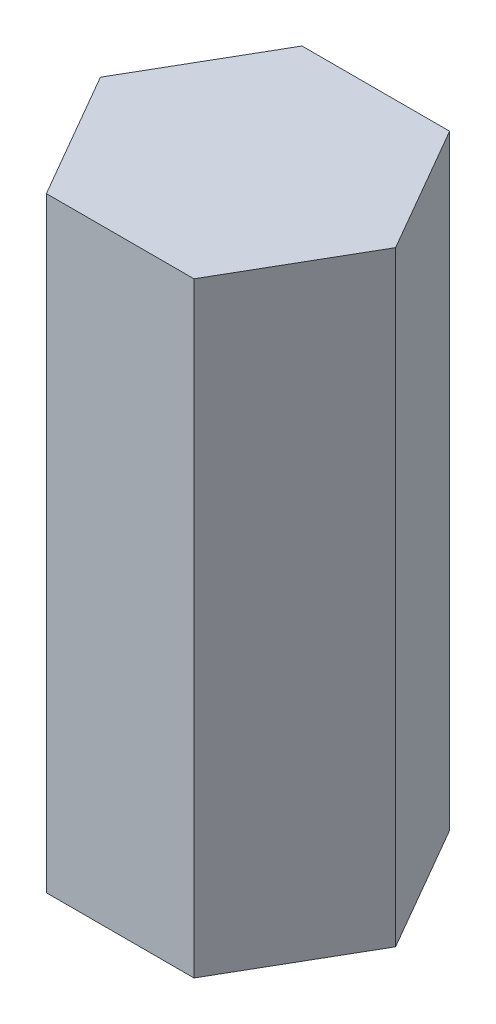
ISO-10303-21;
HEADER;
FILE_DESCRIPTION(('STEP AP214'),'2;1');
FILE_NAME('part.step','',(''),(''),'','','');
FILE_SCHEMA(('AUTOMOTIVE_DESIGN { 1 0 10303 214 1 1 1 1 }'));
ENDSEC;
DATA;
#1=APPLICATION_CONTEXT('core data for automotive mechanical design processes');
#2=APPLICATION_PROTOCOL_DEFINITION('international standard','automotive_design',2000,#1);
#3=PRODUCT_CONTEXT('',#1,'mechanical');
#4=PRODUCT('Part','Part','',(#3));
#5=PRODUCT_RELATED_PRODUCT_CATEGORY('part','',(#4));
#6=PRODUCT_DEFINITION_FORMATION('','',#4);
#7=PRODUCT_DEFINITION_CONTEXT('part definition',#1,'design');
#8=PRODUCT_DEFINITION('design','',#6,#7);
#9=PRODUCT_DEFINITION_SHAPE('','',#8);
#10=(LENGTH_UNIT() NAMED_UNIT(*) SI_UNIT(.MILLI.,.METRE.));
#11=(NAMED_UNIT(*) PLANE_ANGLE_UNIT() SI_UNIT($,.RADIAN.));
#12=(NAMED_UNIT(*) SI_UNIT($,.STERADIAN.) SOLID_ANGLE_UNIT());
#13=UNCERTAINTY_MEASURE_WITH_UNIT(LENGTH_MEASURE(1.E-05),#10,'distance_accuracy_value','');
#14=(GEOMETRIC_REPRESENTATION_CONTEXT(3) GLOBAL_UNCERTAINTY_ASSIGNED_CONTEXT((#13)) GLOBAL_UNIT_ASSIGNED_CONTEXT((#10,
#11,#12)) REPRESENTATION_CONTEXT('',''));
#15=CARTESIAN_POINT('',(0.,0.,0.));
#16=DIRECTION('',(0.,0.,1.));
#17=DIRECTION('',(1.,0.,0.));
#18=AXIS2_PLACEMENT_3D('',#15,#16,#17);
#19=CARTESIAN_POINT('',(9.74999999999999,40.,16.8874953737966));
#20=DIRECTION('',(-0.866025403784439,0.,-0.5));
#21=DIRECTION('',(-0.5,0.,0.866025403784439));
#22=AXIS2_PLACEMENT_3D('',#19,#20,#21);
#23=PLANE('',#22);
#24=DIRECTION('',(0.5,0.,-0.866025403784439));
#25=VECTOR('',#24,1.);
#26=CARTESIAN_POINT('',(9.74999999999999,-40.,16.8874953737966));
#27=LINE('',#26,#25);
#28=CARTESIAN_POINT('',(9.74999999999999,-40.,16.8874953737966));
#29=VERTEX_POINT('',#28);
#30=CARTESIAN_POINT('',(19.5,-40.,0.));
#31=VERTEX_POINT('',#30);
#32=EDGE_CURVE('E131',#29,#31,#27,.T.);
#33=ORIENTED_EDGE('',*,*,#32,.T.);
#34=DIRECTION('',(0.,-1.,0.));
#35=VECTOR('',#34,1.);
#36=CARTESIAN_POINT('',(19.5,40.,0.));
#37=LINE('',#36,#35);
#38=CARTESIAN_POINT('',(19.5,40.,0.));
#39=VERTEX_POINT('',#38);
#40=EDGE_CURVE('E11',#39,#31,#37,.T.);
#41=ORIENTED_EDGE('',*,*,#40,.F.);
#42=DIRECTION('',(0.5,0.,-0.866025403784439));
#43=VECTOR('',#42,1.);
#44=CARTESIAN_POINT('',(9.74999999999999,40.,16.8874953737966));
#45=LINE('',#44,#43);
#46=CARTESIAN_POINT('',(9.74999999999999,40.,16.8874953737966));
#47=VERTEX_POINT('',#46);
#48=EDGE_CURVE('E147',#47,#39,#45,.T.);
#49=ORIENTED_EDGE('',*,*,#48,.F.);
#50=DIRECTION('',(0.,-1.,0.));
#51=VECTOR('',#50,1.);
#52=CARTESIAN_POINT('',(9.74999999999999,40.,16.8874953737966));
#53=LINE('',#52,#51);
#54=EDGE_CURVE('E127',#47,#29,#53,.T.);
#55=ORIENTED_EDGE('',*,*,#54,.T.);
#56=EDGE_LOOP('',(#33,#41,#49,#55));
#57=FACE_BOUND('',#56,.T.);
#58=ADVANCED_FACE('F42',(#57),#23,.F.);
#59=CARTESIAN_POINT('',(19.5,40.,0.));
#60=DIRECTION('',(-0.866025403784439,0.,0.5));
#61=DIRECTION('',(0.5,0.,0.866025403784439));
#62=AXIS2_PLACEMENT_3D('',#59,#60,#61);
#63=PLANE('',#62);
#64=DIRECTION('',(-0.5,0.,-0.866025403784439));
#65=VECTOR('',#64,1.);
#66=CARTESIAN_POINT('',(19.5,-40.,0.));
#67=LINE('',#66,#65);
#68=CARTESIAN_POINT('',(9.74999999999999,-40.,-16.8874953737966));
#69=VERTEX_POINT('',#68);
#70=EDGE_CURVE('E135',#31,#69,#67,.T.);
#71=ORIENTED_EDGE('',*,*,#70,.T.);
#72=DIRECTION('',(0.,-1.,0.));
#73=VECTOR('',#72,1.);
#74=CARTESIAN_POINT('',(9.74999999999999,40.,-16.8874953737966));
#75=LINE('',#74,#73);
#76=CARTESIAN_POINT('',(9.74999999999999,40.,-16.8874953737966));
#77=VERTEX_POINT('',#76);
#78=EDGE_CURVE('E51',#77,#69,#75,.T.);
#79=ORIENTED_EDGE('',*,*,#78,.F.);
#80=DIRECTION('',(-0.5,0.,-0.866025403784439));
#81=VECTOR('',#80,1.);
#82=CARTESIAN_POINT('',(19.5,40.,0.));
#83=LINE('',#82,#81);
#84=EDGE_CURVE('E96',#39,#77,#83,.T.);
#85=ORIENTED_EDGE('',*,*,#84,.F.);
#86=ORIENTED_EDGE('',*,*,#40,.T.);
#87=EDGE_LOOP('',(#71,#79,#85,#86));
#88=FACE_BOUND('',#87,.T.);
#89=ADVANCED_FACE('F175',(#88),#63,.F.);
#90=CARTESIAN_POINT('',(9.74999999999999,40.,-16.8874953737966));
#91=DIRECTION('',(0.,0.,1.));
#92=DIRECTION('',(1.,0.,0.));
#93=AXIS2_PLACEMENT_3D('',#90,#91,#92);
#94=PLANE('',#93);
#95=DIRECTION('',(-1.,0.,0.));
#96=VECTOR('',#95,1.);
#97=CARTESIAN_POINT('',(9.74999999999999,-40.,-16.8874953737966));
#98=LINE('',#97,#96);
#99=CARTESIAN_POINT('',(-9.75,-40.,-16.8874953737966));
#100=VERTEX_POINT('',#99);
#101=EDGE_CURVE('E138',#69,#100,#98,.T.);
#102=ORIENTED_EDGE('',*,*,#101,.T.);
#103=DIRECTION('',(0.,-1.,0.));
#104=VECTOR('',#103,1.);
#105=CARTESIAN_POINT('',(-9.75,40.,-16.8874953737966));
#106=LINE('',#105,#104);
#107=CARTESIAN_POINT('',(-9.75,40.,-16.8874953737966));
#108=VERTEX_POINT('',#107);
#109=EDGE_CURVE('E120',#108,#100,#106,.T.);
#110=ORIENTED_EDGE('',*,*,#109,.F.);
#111=DIRECTION('',(-1.,0.,0.));
#112=VECTOR('',#111,1.);
#113=CARTESIAN_POINT('',(9.74999999999999,40.,-16.8874953737966));
#114=LINE('',#113,#112);
#115=EDGE_CURVE('E109',#77,#108,#114,.T.);
#116=ORIENTED_EDGE('',*,*,#115,.F.);
#117=ORIENTED_EDGE('',*,*,#78,.T.);
#118=EDGE_LOOP('',(#102,#110,#116,#117));
#119=FACE_BOUND('',#118,.T.);
#120=ADVANCED_FACE('F157',(#119),#94,.F.);
#121=CARTESIAN_POINT('',(-9.75,40.,-16.8874953737966));
#122=DIRECTION('',(0.866025403784439,0.,0.5));
#123=DIRECTION('',(0.5,0.,-0.866025403784439));
#124=AXIS2_PLACEMENT_3D('',#121,#122,#123);
#125=PLANE('',#124);
#126=DIRECTION('',(-0.5,0.,0.866025403784439));
#127=VECTOR('',#126,1.);
#128=CARTESIAN_POINT('',(-9.75,-40.,-16.8874953737966));
#129=LINE('',#128,#127);
#130=CARTESIAN_POINT('',(-19.5,-40.,0.));
#131=VERTEX_POINT('',#130);
#132=EDGE_CURVE('E118',#100,#131,#129,.T.);
#133=ORIENTED_EDGE('',*,*,#132,.T.);
#134=DIRECTION('',(0.,-1.,0.));
#135=VECTOR('',#134,1.);
#136=CARTESIAN_POINT('',(-19.5,40.,0.));
#137=LINE('',#136,#135);
#138=CARTESIAN_POINT('',(-19.5,40.,0.));
#139=VERTEX_POINT('',#138);
#140=EDGE_CURVE('E115',#139,#131,#137,.T.);
#141=ORIENTED_EDGE('',*,*,#140,.F.);
#142=DIRECTION('',(-0.5,0.,0.866025403784439));
#143=VECTOR('',#142,1.);
#144=CARTESIAN_POINT('',(-9.75,40.,-16.8874953737966));
#145=LINE('',#144,#143);
#146=EDGE_CURVE('E103',#108,#139,#145,.T.);
#147=ORIENTED_EDGE('',*,*,#146,.F.);
#148=ORIENTED_EDGE('',*,*,#109,.T.);
#149=EDGE_LOOP('',(#133,#141,#147,#148));
#150=FACE_BOUND('',#149,.T.);
#151=ADVANCED_FACE('F116',(#150),#125,.F.);
#152=CARTESIAN_POINT('',(-19.5,40.,0.));
#153=DIRECTION('',(0.866025403784439,0.,-0.5));
#154=DIRECTION('',(-0.5,0.,-0.866025403784439));
#155=AXIS2_PLACEMENT_3D('',#152,#153,#154);
#156=PLANE('',#155);
#157=DIRECTION('',(0.5,0.,0.866025403784439));
#158=VECTOR('',#157,1.);
#159=CARTESIAN_POINT('',(-19.5,-40.,0.));
#160=LINE('',#159,#158);
#161=CARTESIAN_POINT('',(-9.75000000000001,-40.,16.8874953737966));
#162=VERTEX_POINT('',#161);
#163=EDGE_CURVE('E82',#131,#162,#160,.T.);
#164=ORIENTED_EDGE('',*,*,#163,.T.);
#165=DIRECTION('',(0.,-1.,0.));
#166=VECTOR('',#165,1.);
#167=CARTESIAN_POINT('',(-9.75000000000001,40.,16.8874953737966));
#168=LINE('',#167,#166);
#169=CARTESIAN_POINT('',(-9.75000000000001,40.,16.8874953737966));
#170=VERTEX_POINT('',#169);
#171=EDGE_CURVE('E121',#170,#162,#168,.T.);
#172=ORIENTED_EDGE('',*,*,#171,.F.);
#173=DIRECTION('',(0.5,0.,0.866025403784439));
#174=VECTOR('',#173,1.);
#175=CARTESIAN_POINT('',(-19.5,40.,0.));
#176=LINE('',#175,#174);
#177=EDGE_CURVE('E107',#139,#170,#176,.T.);
#178=ORIENTED_EDGE('',*,*,#177,.F.);
#179=ORIENTED_EDGE('',*,*,#140,.T.);
#180=EDGE_LOOP('',(#164,#172,#178,#179));
#181=FACE_BOUND('',#180,.T.);
#182=ADVANCED_FACE('F123',(#181),#156,.F.);
#183=CARTESIAN_POINT('',(-9.75000000000001,40.,16.8874953737966));
#184=DIRECTION('',(0.,0.,-1.));
#185=DIRECTION('',(-1.,0.,0.));
#186=AXIS2_PLACEMENT_3D('',#183,#184,#185);
#187=PLANE('',#186);
#188=DIRECTION('',(1.,0.,0.));
#189=VECTOR('',#188,1.);
#190=CARTESIAN_POINT('',(-9.75000000000001,-40.,16.8874953737966));
#191=LINE('',#190,#189);
#192=EDGE_CURVE('E88',#162,#29,#191,.T.);
#193=ORIENTED_EDGE('',*,*,#192,.T.);
#194=ORIENTED_EDGE('',*,*,#54,.F.);
#195=DIRECTION('',(1.,0.,0.));
#196=VECTOR('',#195,1.);
#197=CARTESIAN_POINT('',(-9.75000000000001,40.,16.8874953737966));
#198=LINE('',#197,#196);
#199=EDGE_CURVE('E59',#170,#47,#198,.T.);
#200=ORIENTED_EDGE('',*,*,#199,.F.);
#201=ORIENTED_EDGE('',*,*,#171,.T.);
#202=EDGE_LOOP('',(#193,#194,#200,#201));
#203=FACE_BOUND('',#202,.T.);
#204=ADVANCED_FACE('F164',(#203),#187,.F.);
#205=CARTESIAN_POINT('',(0.,40.,0.));
#206=DIRECTION('',(0.,1.,0.));
#207=DIRECTION('',(0.,0.,1.));
#208=AXIS2_PLACEMENT_3D('',#205,#206,#207);
#209=PLANE('',#208);
#210=ORIENTED_EDGE('',*,*,#48,.T.);
#211=ORIENTED_EDGE('',*,*,#84,.T.);
#212=ORIENTED_EDGE('',*,*,#115,.T.);
#213=ORIENTED_EDGE('',*,*,#146,.T.);
#214=ORIENTED_EDGE('',*,*,#177,.T.);
#215=ORIENTED_EDGE('',*,*,#199,.T.);
#216=EDGE_LOOP('',(#210,#211,#212,#213,#214,#215));
#217=FACE_BOUND('',#216,.T.);
#218=ADVANCED_FACE('F105',(#217),#209,.T.);
#219=CARTESIAN_POINT('',(0.,-40.,0.));
#220=DIRECTION('',(0.,1.,0.));
#221=DIRECTION('',(0.,0.,1.));
#222=AXIS2_PLACEMENT_3D('',#219,#220,#221);
#223=PLANE('',#222);
#224=ORIENTED_EDGE('',*,*,#32,.F.);
#225=ORIENTED_EDGE('',*,*,#192,.F.);
#226=ORIENTED_EDGE('',*,*,#163,.F.);
#227=ORIENTED_EDGE('',*,*,#132,.F.);
#228=ORIENTED_EDGE('',*,*,#101,.F.);
#229=ORIENTED_EDGE('',*,*,#70,.F.);
#230=EDGE_LOOP('',(#224,#225,#226,#227,#228,#229));
#231=FACE_BOUND('',#230,.T.);
#232=ADVANCED_FACE('F160',(#231),#223,.F.);
#233=CLOSED_SHELL('',(#58,#89,#120,#151,#182,#204,#218,#232));
#234=MANIFOLD_SOLID_BREP('B2',#233);
#235=ADVANCED_BREP_SHAPE_REPRESENTATION('',(#18,#234),#14);
#236=SHAPE_DEFINITION_REPRESENTATION(#9,#235);
ENDSEC;
END-ISO-10303-21;
